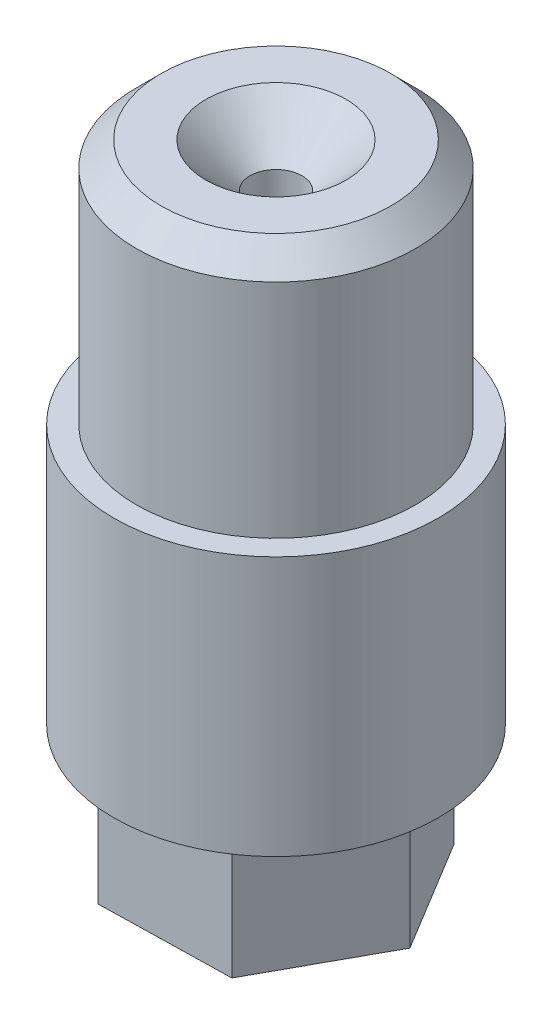
ISO-10303-21;
HEADER;
FILE_DESCRIPTION(('STEP AP214'),'2;1');
FILE_NAME('part.step','',(''),(''),'','','');
FILE_SCHEMA(('AUTOMOTIVE_DESIGN { 1 0 10303 214 1 1 1 1 }'));
ENDSEC;
DATA;
#1=APPLICATION_CONTEXT('core data for automotive mechanical design processes');
#2=APPLICATION_PROTOCOL_DEFINITION('international standard','automotive_design',2000,#1);
#3=PRODUCT_CONTEXT('',#1,'mechanical');
#4=PRODUCT('Part','Part','',(#3));
#5=PRODUCT_RELATED_PRODUCT_CATEGORY('part','',(#4));
#6=PRODUCT_DEFINITION_FORMATION('','',#4);
#7=PRODUCT_DEFINITION_CONTEXT('part definition',#1,'design');
#8=PRODUCT_DEFINITION('design','',#6,#7);
#9=PRODUCT_DEFINITION_SHAPE('','',#8);
#10=(LENGTH_UNIT() NAMED_UNIT(*) SI_UNIT(.MILLI.,.METRE.));
#11=(NAMED_UNIT(*) PLANE_ANGLE_UNIT() SI_UNIT($,.RADIAN.));
#12=(NAMED_UNIT(*) SI_UNIT($,.STERADIAN.) SOLID_ANGLE_UNIT());
#13=UNCERTAINTY_MEASURE_WITH_UNIT(LENGTH_MEASURE(1.E-05),#10,'distance_accuracy_value','');
#14=(GEOMETRIC_REPRESENTATION_CONTEXT(3) GLOBAL_UNCERTAINTY_ASSIGNED_CONTEXT((#13)) GLOBAL_UNIT_ASSIGNED_CONTEXT((#10,
#11,#12)) REPRESENTATION_CONTEXT('',''));
#15=CARTESIAN_POINT('',(0.,0.,0.));
#16=DIRECTION('',(0.,0.,1.));
#17=DIRECTION('',(1.,0.,0.));
#18=AXIS2_PLACEMENT_3D('',#15,#16,#17);
#19=CARTESIAN_POINT('',(-15.875,0.,0.));
#20=DIRECTION('',(0.,-1.,0.));
#21=DIRECTION('',(0.,0.,-1.));
#22=AXIS2_PLACEMENT_3D('',#19,#20,#21);
#23=PLANE('',#22);
#24=CARTESIAN_POINT('',(0.,0.,0.));
#25=DIRECTION('',(0.,1.,0.));
#26=DIRECTION('',(0.,0.,1.));
#27=AXIS2_PLACEMENT_3D('',#24,#25,#26);
#28=CIRCLE('',#27,15.875);
#29=CARTESIAN_POINT('',(0.,0.,15.875));
#30=VERTEX_POINT('',#29);
#31=EDGE_CURVE('E148',#30,#30,#28,.T.);
#32=ORIENTED_EDGE('',*,*,#31,.F.);
#33=EDGE_LOOP('',(#32));
#34=FACE_BOUND('',#33,.T.);
#35=DIRECTION('',(0.481389167595675,0.,-0.876506970492274));
#36=VECTOR('',#35,1.);
#37=CARTESIAN_POINT('',(-12.8286826736734,0.,0.274060561784372));
#38=LINE('',#37,#36);
#39=CARTESIAN_POINT('',(-12.8286826736734,0.,0.274060561784372));
#40=VERTEX_POINT('',#39);
#41=CARTESIAN_POINT('',(-6.65168474551739,0.,-10.9729348115982));
#42=VERTEX_POINT('',#41);
#43=EDGE_CURVE('E124',#40,#42,#38,.T.);
#44=ORIENTED_EDGE('',*,*,#43,.F.);
#45=DIRECTION('',(-0.518382719242609,0.,-0.855148733490636));
#46=VECTOR('',#45,1.);
#47=CARTESIAN_POINT('',(-6.17699792815599,0.,11.2469953733826));
#48=LINE('',#47,#46);
#49=CARTESIAN_POINT('',(-6.17699792815599,0.,11.2469953733826));
#50=VERTEX_POINT('',#49);
#51=EDGE_CURVE('E121',#50,#40,#48,.T.);
#52=ORIENTED_EDGE('',*,*,#51,.F.);
#53=DIRECTION('',(-0.999771886838284,0.,0.021358237001638));
#54=VECTOR('',#53,1.);
#55=CARTESIAN_POINT('',(6.65168474551739,0.,10.9729348115982));
#56=LINE('',#55,#54);
#57=CARTESIAN_POINT('',(6.65168474551739,0.,10.9729348115982));
#58=VERTEX_POINT('',#57);
#59=EDGE_CURVE('E80',#58,#50,#56,.T.);
#60=ORIENTED_EDGE('',*,*,#59,.F.);
#61=DIRECTION('',(-0.481389167595675,0.,0.876506970492274));
#62=VECTOR('',#61,1.);
#63=CARTESIAN_POINT('',(12.8286826736734,0.,-0.27406056178437));
#64=LINE('',#63,#62);
#65=CARTESIAN_POINT('',(12.8286826736734,0.,-0.27406056178437));
#66=VERTEX_POINT('',#65);
#67=EDGE_CURVE('E130',#66,#58,#64,.T.);
#68=ORIENTED_EDGE('',*,*,#67,.F.);
#69=DIRECTION('',(0.518382719242609,0.,0.855148733490636));
#70=VECTOR('',#69,1.);
#71=CARTESIAN_POINT('',(6.17699792815599,0.,-11.2469953733826));
#72=LINE('',#71,#70);
#73=CARTESIAN_POINT('',(6.17699792815599,0.,-11.2469953733826));
#74=VERTEX_POINT('',#73);
#75=EDGE_CURVE('E110',#74,#66,#72,.T.);
#76=ORIENTED_EDGE('',*,*,#75,.F.);
#77=DIRECTION('',(0.999771886838284,0.,-0.0213582370016382));
#78=VECTOR('',#77,1.);
#79=CARTESIAN_POINT('',(-6.65168474551739,0.,-10.9729348115982));
#80=LINE('',#79,#78);
#81=EDGE_CURVE('E127',#42,#74,#80,.T.);
#82=ORIENTED_EDGE('',*,*,#81,.F.);
#83=EDGE_LOOP('',(#44,#52,#60,#68,#76,#82));
#84=FACE_BOUND('',#83,.T.);
#85=ADVANCED_FACE('F37',(#34,#84),#23,.T.);
#86=CARTESIAN_POINT('',(0.,110.151211274222,0.));
#87=DIRECTION('',(0.,1.,0.));
#88=DIRECTION('',(0.,0.,1.));
#89=AXIS2_PLACEMENT_3D('',#86,#87,#88);
#90=CYLINDRICAL_SURFACE('',#89,13.64869);
#91=CARTESIAN_POINT('',(0.,47.117,0.));
#92=DIRECTION('',(0.,1.,0.));
#93=DIRECTION('',(0.,0.,1.));
#94=AXIS2_PLACEMENT_3D('',#91,#92,#93);
#95=CIRCLE('',#94,13.64869);
#96=CARTESIAN_POINT('',(0.,47.117,13.64869));
#97=VERTEX_POINT('',#96);
#98=EDGE_CURVE('E11',#97,#97,#95,.F.);
#99=ORIENTED_EDGE('',*,*,#98,.T.);
#100=EDGE_LOOP('',(#99));
#101=FACE_BOUND('',#100,.T.);
#102=CARTESIAN_POINT('',(0.,25.4,0.));
#103=DIRECTION('',(0.,1.,0.));
#104=DIRECTION('',(0.,0.,1.));
#105=AXIS2_PLACEMENT_3D('',#102,#103,#104);
#106=CIRCLE('',#105,13.64869);
#107=CARTESIAN_POINT('',(0.,25.4,13.64869));
#108=VERTEX_POINT('',#107);
#109=EDGE_CURVE('E142',#108,#108,#106,.T.);
#110=ORIENTED_EDGE('',*,*,#109,.T.);
#111=EDGE_LOOP('',(#110));
#112=FACE_BOUND('',#111,.T.);
#113=ADVANCED_FACE('F173',(#101,#112),#90,.T.);
#114=CARTESIAN_POINT('',(-13.64869,49.53,0.));
#115=DIRECTION('',(0.,1.,0.));
#116=DIRECTION('',(0.,0.,1.));
#117=AXIS2_PLACEMENT_3D('',#114,#115,#116);
#118=PLANE('',#117);
#119=CARTESIAN_POINT('',(0.,49.53,0.));
#120=DIRECTION('',(0.,1.,0.));
#121=DIRECTION('',(0.,0.,1.));
#122=AXIS2_PLACEMENT_3D('',#119,#120,#121);
#123=CIRCLE('',#122,11.23569);
#124=CARTESIAN_POINT('',(0.,49.53,11.23569));
#125=VERTEX_POINT('',#124);
#126=EDGE_CURVE('E45',#125,#125,#123,.T.);
#127=ORIENTED_EDGE('',*,*,#126,.T.);
#128=EDGE_LOOP('',(#127));
#129=FACE_BOUND('',#128,.T.);
#130=CARTESIAN_POINT('',(0.,49.53,0.));
#131=DIRECTION('',(0.,1.,0.));
#132=DIRECTION('',(0.,0.,1.));
#133=AXIS2_PLACEMENT_3D('',#130,#131,#132);
#134=CIRCLE('',#133,6.858);
#135=CARTESIAN_POINT('',(0.,49.53,6.858));
#136=VERTEX_POINT('',#135);
#137=EDGE_CURVE('E151',#136,#136,#134,.T.);
#138=ORIENTED_EDGE('',*,*,#137,.F.);
#139=EDGE_LOOP('',(#138));
#140=FACE_BOUND('',#139,.T.);
#141=ADVANCED_FACE('F156',(#129,#140),#118,.T.);
#142=CARTESIAN_POINT('',(0.,42.672,0.));
#143=DIRECTION('',(0.,1.,0.));
#144=DIRECTION('',(0.,0.,1.));
#145=AXIS2_PLACEMENT_3D('',#142,#143,#144);
#146=CONICAL_SURFACE('',#145,0.,0.785398163397448);
#147=CARTESIAN_POINT('',(0.,45.212,0.));
#148=DIRECTION('',(0.,1.,0.));
#149=DIRECTION('',(0.,0.,1.));
#150=AXIS2_PLACEMENT_3D('',#147,#148,#149);
#151=CIRCLE('',#150,2.54);
#152=CARTESIAN_POINT('',(0.,45.212,2.54));
#153=VERTEX_POINT('',#152);
#154=EDGE_CURVE('E125',#153,#153,#151,.T.);
#155=ORIENTED_EDGE('',*,*,#154,.F.);
#156=EDGE_LOOP('',(#155));
#157=FACE_BOUND('',#156,.T.);
#158=ORIENTED_EDGE('',*,*,#137,.T.);
#159=EDGE_LOOP('',(#158));
#160=FACE_BOUND('',#159,.T.);
#161=ADVANCED_FACE('F186',(#157,#160),#146,.F.);
#162=CARTESIAN_POINT('',(0.,110.151211274222,0.));
#163=DIRECTION('',(0.,1.,0.));
#164=DIRECTION('',(0.,0.,1.));
#165=AXIS2_PLACEMENT_3D('',#162,#163,#164);
#166=CYLINDRICAL_SURFACE('',#165,15.875);
#167=ORIENTED_EDGE('',*,*,#31,.T.);
#168=EDGE_LOOP('',(#167));
#169=FACE_BOUND('',#168,.T.);
#170=CARTESIAN_POINT('',(0.,25.4,0.));
#171=DIRECTION('',(0.,1.,0.));
#172=DIRECTION('',(0.,0.,1.));
#173=AXIS2_PLACEMENT_3D('',#170,#171,#172);
#174=CIRCLE('',#173,15.875);
#175=CARTESIAN_POINT('',(0.,25.4,15.875));
#176=VERTEX_POINT('',#175);
#177=EDGE_CURVE('E145',#176,#176,#174,.T.);
#178=ORIENTED_EDGE('',*,*,#177,.F.);
#179=EDGE_LOOP('',(#178));
#180=FACE_BOUND('',#179,.T.);
#181=ADVANCED_FACE('F184',(#169,#180),#166,.T.);
#182=CARTESIAN_POINT('',(-15.875,25.4,0.));
#183=DIRECTION('',(0.,1.,0.));
#184=DIRECTION('',(0.,0.,1.));
#185=AXIS2_PLACEMENT_3D('',#182,#183,#184);
#186=PLANE('',#185);
#187=ORIENTED_EDGE('',*,*,#177,.T.);
#188=EDGE_LOOP('',(#187));
#189=FACE_BOUND('',#188,.T.);
#190=ORIENTED_EDGE('',*,*,#109,.F.);
#191=EDGE_LOOP('',(#190));
#192=FACE_BOUND('',#191,.T.);
#193=ADVANCED_FACE('F206',(#189,#192),#186,.T.);
#194=CARTESIAN_POINT('',(-6.17699792815599,-12.7,11.2469953733826));
#195=DIRECTION('',(0.855148733490636,0.,-0.518382719242609));
#196=DIRECTION('',(-0.518382719242609,0.,-0.855148733490636));
#197=AXIS2_PLACEMENT_3D('',#194,#195,#196);
#198=PLANE('',#197);
#199=ORIENTED_EDGE('',*,*,#51,.T.);
#200=DIRECTION('',(0.,1.,0.));
#201=VECTOR('',#200,1.);
#202=CARTESIAN_POINT('',(-12.8286826736734,-12.7,0.274060561784372));
#203=LINE('',#202,#201);
#204=CARTESIAN_POINT('',(-12.8286826736734,-12.7,0.274060561784372));
#205=VERTEX_POINT('',#204);
#206=EDGE_CURVE('E140',#205,#40,#203,.T.);
#207=ORIENTED_EDGE('',*,*,#206,.F.);
#208=DIRECTION('',(-0.518382719242609,0.,-0.855148733490636));
#209=VECTOR('',#208,1.);
#210=CARTESIAN_POINT('',(-6.17699792815599,-12.7,11.2469953733826));
#211=LINE('',#210,#209);
#212=CARTESIAN_POINT('',(-6.17699792815599,-12.7,11.2469953733826));
#213=VERTEX_POINT('',#212);
#214=EDGE_CURVE('E133',#213,#205,#211,.T.);
#215=ORIENTED_EDGE('',*,*,#214,.F.);
#216=DIRECTION('',(0.,1.,0.));
#217=VECTOR('',#216,1.);
#218=CARTESIAN_POINT('',(-6.17699792815599,-12.7,11.2469953733826));
#219=LINE('',#218,#217);
#220=EDGE_CURVE('E117',#213,#50,#219,.T.);
#221=ORIENTED_EDGE('',*,*,#220,.T.);
#222=EDGE_LOOP('',(#199,#207,#215,#221));
#223=FACE_BOUND('',#222,.T.);
#224=ADVANCED_FACE('F213',(#223),#198,.F.);
#225=CARTESIAN_POINT('',(-12.8286826736734,-12.7,0.274060561784372));
#226=DIRECTION('',(0.876506970492274,0.,0.481389167595675));
#227=DIRECTION('',(0.481389167595675,0.,-0.876506970492274));
#228=AXIS2_PLACEMENT_3D('',#225,#226,#227);
#229=PLANE('',#228);
#230=ORIENTED_EDGE('',*,*,#43,.T.);
#231=DIRECTION('',(0.,1.,0.));
#232=VECTOR('',#231,1.);
#233=CARTESIAN_POINT('',(-6.65168474551739,-12.7,-10.9729348115982));
#234=LINE('',#233,#232);
#235=CARTESIAN_POINT('',(-6.65168474551739,-12.7,-10.9729348115982));
#236=VERTEX_POINT('',#235);
#237=EDGE_CURVE('E137',#236,#42,#234,.T.);
#238=ORIENTED_EDGE('',*,*,#237,.F.);
#239=DIRECTION('',(0.481389167595675,0.,-0.876506970492274));
#240=VECTOR('',#239,1.);
#241=CARTESIAN_POINT('',(-12.8286826736734,-12.7,0.274060561784372));
#242=LINE('',#241,#240);
#243=EDGE_CURVE('E88',#205,#236,#242,.T.);
#244=ORIENTED_EDGE('',*,*,#243,.F.);
#245=ORIENTED_EDGE('',*,*,#206,.T.);
#246=EDGE_LOOP('',(#230,#238,#244,#245));
#247=FACE_BOUND('',#246,.T.);
#248=ADVANCED_FACE('F220',(#247),#229,.F.);
#249=CARTESIAN_POINT('',(-6.65168474551739,-12.7,-10.9729348115982));
#250=DIRECTION('',(0.0213582370016382,0.,0.999771886838284));
#251=DIRECTION('',(0.999771886838284,0.,-0.0213582370016382));
#252=AXIS2_PLACEMENT_3D('',#249,#250,#251);
#253=PLANE('',#252);
#254=ORIENTED_EDGE('',*,*,#81,.T.);
#255=DIRECTION('',(0.,1.,0.));
#256=VECTOR('',#255,1.);
#257=CARTESIAN_POINT('',(6.17699792815599,-12.7,-11.2469953733826));
#258=LINE('',#257,#256);
#259=CARTESIAN_POINT('',(6.17699792815599,-12.7,-11.2469953733826));
#260=VERTEX_POINT('',#259);
#261=EDGE_CURVE('E113',#260,#74,#258,.T.);
#262=ORIENTED_EDGE('',*,*,#261,.F.);
#263=DIRECTION('',(0.999771886838284,0.,-0.0213582370016382));
#264=VECTOR('',#263,1.);
#265=CARTESIAN_POINT('',(-6.65168474551739,-12.7,-10.9729348115982));
#266=LINE('',#265,#264);
#267=EDGE_CURVE('E101',#236,#260,#266,.T.);
#268=ORIENTED_EDGE('',*,*,#267,.F.);
#269=ORIENTED_EDGE('',*,*,#237,.T.);
#270=EDGE_LOOP('',(#254,#262,#268,#269));
#271=FACE_BOUND('',#270,.T.);
#272=ADVANCED_FACE('F228',(#271),#253,.F.);
#273=CARTESIAN_POINT('',(6.17699792815599,-12.7,-11.2469953733826));
#274=DIRECTION('',(-0.855148733490636,0.,0.518382719242609));
#275=DIRECTION('',(0.518382719242609,0.,0.855148733490636));
#276=AXIS2_PLACEMENT_3D('',#273,#274,#275);
#277=PLANE('',#276);
#278=ORIENTED_EDGE('',*,*,#75,.T.);
#279=DIRECTION('',(0.,1.,0.));
#280=VECTOR('',#279,1.);
#281=CARTESIAN_POINT('',(12.8286826736734,-12.7,-0.27406056178437));
#282=LINE('',#281,#280);
#283=CARTESIAN_POINT('',(12.8286826736734,-12.7,-0.27406056178437));
#284=VERTEX_POINT('',#283);
#285=EDGE_CURVE('E107',#284,#66,#282,.T.);
#286=ORIENTED_EDGE('',*,*,#285,.F.);
#287=DIRECTION('',(0.518382719242609,0.,0.855148733490636));
#288=VECTOR('',#287,1.);
#289=CARTESIAN_POINT('',(6.17699792815599,-12.7,-11.2469953733826));
#290=LINE('',#289,#288);
#291=EDGE_CURVE('E95',#260,#284,#290,.T.);
#292=ORIENTED_EDGE('',*,*,#291,.F.);
#293=ORIENTED_EDGE('',*,*,#261,.T.);
#294=EDGE_LOOP('',(#278,#286,#292,#293));
#295=FACE_BOUND('',#294,.T.);
#296=ADVANCED_FACE('F108',(#295),#277,.F.);
#297=CARTESIAN_POINT('',(12.8286826736734,-12.7,-0.27406056178437));
#298=DIRECTION('',(-0.876506970492274,0.,-0.481389167595675));
#299=DIRECTION('',(-0.481389167595675,0.,0.876506970492274));
#300=AXIS2_PLACEMENT_3D('',#297,#298,#299);
#301=PLANE('',#300);
#302=ORIENTED_EDGE('',*,*,#67,.T.);
#303=DIRECTION('',(0.,1.,0.));
#304=VECTOR('',#303,1.);
#305=CARTESIAN_POINT('',(6.65168474551739,-12.7,10.9729348115982));
#306=LINE('',#305,#304);
#307=CARTESIAN_POINT('',(6.65168474551739,-12.7,10.9729348115982));
#308=VERTEX_POINT('',#307);
#309=EDGE_CURVE('E52',#308,#58,#306,.T.);
#310=ORIENTED_EDGE('',*,*,#309,.F.);
#311=DIRECTION('',(-0.481389167595675,0.,0.876506970492274));
#312=VECTOR('',#311,1.);
#313=CARTESIAN_POINT('',(12.8286826736734,-12.7,-0.27406056178437));
#314=LINE('',#313,#312);
#315=EDGE_CURVE('E99',#284,#308,#314,.T.);
#316=ORIENTED_EDGE('',*,*,#315,.F.);
#317=ORIENTED_EDGE('',*,*,#285,.T.);
#318=EDGE_LOOP('',(#302,#310,#316,#317));
#319=FACE_BOUND('',#318,.T.);
#320=ADVANCED_FACE('F115',(#319),#301,.F.);
#321=CARTESIAN_POINT('',(6.65168474551739,-12.7,10.9729348115982));
#322=DIRECTION('',(-0.021358237001638,0.,-0.999771886838284));
#323=DIRECTION('',(-0.999771886838284,0.,0.021358237001638));
#324=AXIS2_PLACEMENT_3D('',#321,#322,#323);
#325=PLANE('',#324);
#326=ORIENTED_EDGE('',*,*,#59,.T.);
#327=ORIENTED_EDGE('',*,*,#220,.F.);
#328=DIRECTION('',(-0.999771886838284,0.,0.021358237001638));
#329=VECTOR('',#328,1.);
#330=CARTESIAN_POINT('',(6.65168474551739,-12.7,10.9729348115982));
#331=LINE('',#330,#329);
#332=EDGE_CURVE('E60',#308,#213,#331,.T.);
#333=ORIENTED_EDGE('',*,*,#332,.F.);
#334=ORIENTED_EDGE('',*,*,#309,.T.);
#335=EDGE_LOOP('',(#326,#327,#333,#334));
#336=FACE_BOUND('',#335,.T.);
#337=ADVANCED_FACE('F168',(#336),#325,.F.);
#338=CARTESIAN_POINT('',(0.,-12.7,0.));
#339=DIRECTION('',(0.,-1.,0.));
#340=DIRECTION('',(0.,0.,-1.));
#341=AXIS2_PLACEMENT_3D('',#338,#339,#340);
#342=PLANE('',#341);
#343=CARTESIAN_POINT('',(0.,-12.7,0.));
#344=DIRECTION('',(0.,-1.,0.));
#345=DIRECTION('',(0.,0.,-1.));
#346=AXIS2_PLACEMENT_3D('',#343,#344,#345);
#347=CIRCLE('',#346,2.54);
#348=CARTESIAN_POINT('',(0.,-12.7,-2.54));
#349=VERTEX_POINT('',#348);
#350=EDGE_CURVE('E311',#349,#349,#347,.T.);
#351=ORIENTED_EDGE('',*,*,#350,.F.);
#352=EDGE_LOOP('',(#351));
#353=FACE_BOUND('',#352,.T.);
#354=ORIENTED_EDGE('',*,*,#214,.T.);
#355=ORIENTED_EDGE('',*,*,#243,.T.);
#356=ORIENTED_EDGE('',*,*,#267,.T.);
#357=ORIENTED_EDGE('',*,*,#291,.T.);
#358=ORIENTED_EDGE('',*,*,#315,.T.);
#359=ORIENTED_EDGE('',*,*,#332,.T.);
#360=EDGE_LOOP('',(#354,#355,#356,#357,#358,#359));
#361=FACE_BOUND('',#360,.T.);
#362=ADVANCED_FACE('F97',(#353,#361),#342,.T.);
#363=CARTESIAN_POINT('',(0.,49.53,0.));
#364=DIRECTION('',(0.,-1.,0.));
#365=DIRECTION('',(0.,0.,-1.));
#366=AXIS2_PLACEMENT_3D('',#363,#364,#365);
#367=CONICAL_SURFACE('',#366,11.23569,0.785398163397447);
#368=ORIENTED_EDGE('',*,*,#98,.F.);
#369=EDGE_LOOP('',(#368));
#370=FACE_BOUND('',#369,.T.);
#371=ORIENTED_EDGE('',*,*,#126,.F.);
#372=EDGE_LOOP('',(#371));
#373=FACE_BOUND('',#372,.T.);
#374=ADVANCED_FACE('F39',(#370,#373),#367,.T.);
#375=CARTESIAN_POINT('',(0.,49.53,0.));
#376=DIRECTION('',(0.,-1.,0.));
#377=DIRECTION('',(0.,0.,-1.));
#378=AXIS2_PLACEMENT_3D('',#375,#376,#377);
#379=CYLINDRICAL_SURFACE('',#378,2.54);
#380=ORIENTED_EDGE('',*,*,#154,.T.);
#381=EDGE_LOOP('',(#380));
#382=FACE_BOUND('',#381,.T.);
#383=ORIENTED_EDGE('',*,*,#350,.T.);
#384=EDGE_LOOP('',(#383));
#385=FACE_BOUND('',#384,.T.);
#386=ADVANCED_FACE('F160',(#382,#385),#379,.F.);
#387=CLOSED_SHELL('',(#85,#113,#141,#161,#181,#193,#224,#248,#272,#296,#320,#337,#362,#374,#386));
#388=MANIFOLD_SOLID_BREP('B2',#387);
#389=ADVANCED_BREP_SHAPE_REPRESENTATION('',(#18,#388),#14);
#390=SHAPE_DEFINITION_REPRESENTATION(#9,#389);
ENDSEC;
END-ISO-10303-21;
